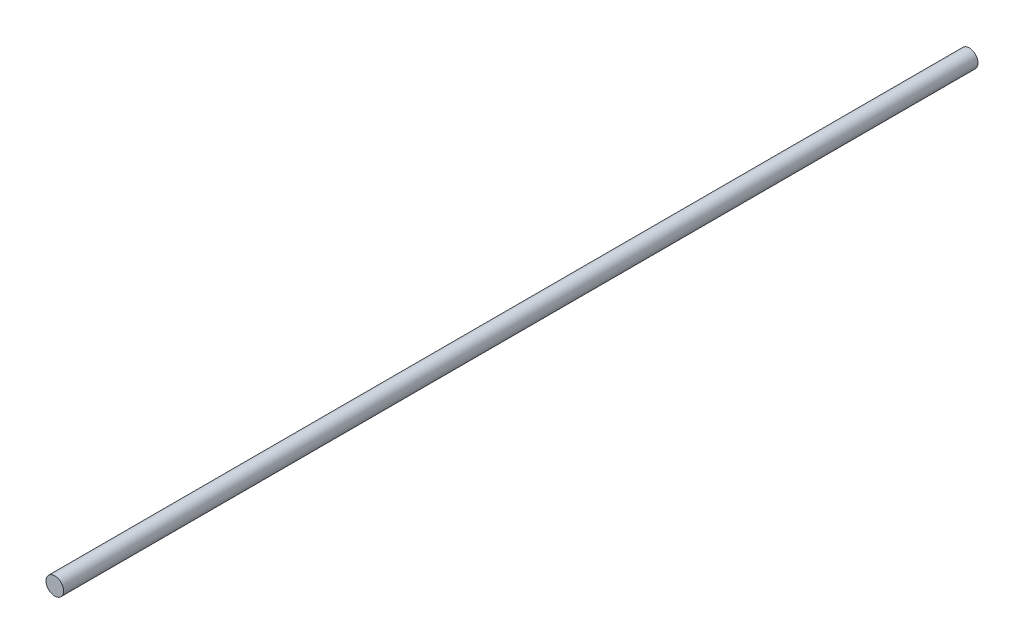
ISO-10303-21;
HEADER;
FILE_DESCRIPTION(('STEP AP214'),'2;1');
FILE_NAME('part.step','',(''),(''),'','','');
FILE_SCHEMA(('AUTOMOTIVE_DESIGN { 1 0 10303 214 1 1 1 1 }'));
ENDSEC;
DATA;
#1=APPLICATION_CONTEXT('core data for automotive mechanical design processes');
#2=APPLICATION_PROTOCOL_DEFINITION('international standard','automotive_design',2000,#1);
#3=PRODUCT_CONTEXT('',#1,'mechanical');
#4=PRODUCT('Part','Part','',(#3));
#5=PRODUCT_RELATED_PRODUCT_CATEGORY('part','',(#4));
#6=PRODUCT_DEFINITION_FORMATION('','',#4);
#7=PRODUCT_DEFINITION_CONTEXT('part definition',#1,'design');
#8=PRODUCT_DEFINITION('design','',#6,#7);
#9=PRODUCT_DEFINITION_SHAPE('','',#8);
#10=(LENGTH_UNIT() NAMED_UNIT(*) SI_UNIT(.MILLI.,.METRE.));
#11=(NAMED_UNIT(*) PLANE_ANGLE_UNIT() SI_UNIT($,.RADIAN.));
#12=(NAMED_UNIT(*) SI_UNIT($,.STERADIAN.) SOLID_ANGLE_UNIT());
#13=UNCERTAINTY_MEASURE_WITH_UNIT(LENGTH_MEASURE(1.E-05),#10,'distance_accuracy_value','');
#14=(GEOMETRIC_REPRESENTATION_CONTEXT(3) GLOBAL_UNCERTAINTY_ASSIGNED_CONTEXT((#13)) GLOBAL_UNIT_ASSIGNED_CONTEXT((#10,
#11,#12)) REPRESENTATION_CONTEXT('',''));
#15=CARTESIAN_POINT('',(0.,0.,0.));
#16=DIRECTION('',(0.,0.,1.));
#17=DIRECTION('',(1.,0.,0.));
#18=AXIS2_PLACEMENT_3D('',#15,#16,#17);
#19=CARTESIAN_POINT('',(0.,0.,260.));
#20=DIRECTION('',(0.,0.,-1.));
#21=DIRECTION('',(-1.,0.,0.));
#22=AXIS2_PLACEMENT_3D('',#19,#20,#21);
#23=CYLINDRICAL_SURFACE('',#22,2.5);
#24=CARTESIAN_POINT('',(0.,0.,260.));
#25=DIRECTION('',(0.,0.,1.));
#26=DIRECTION('',(1.,0.,0.));
#27=AXIS2_PLACEMENT_3D('',#24,#25,#26);
#28=CIRCLE('',#27,2.5);
#29=CARTESIAN_POINT('',(2.5,0.,260.));
#30=VERTEX_POINT('',#29);
#31=EDGE_CURVE('E10',#30,#30,#28,.T.);
#32=ORIENTED_EDGE('',*,*,#31,.F.);
#33=EDGE_LOOP('',(#32));
#34=FACE_BOUND('',#33,.T.);
#35=CARTESIAN_POINT('',(0.,0.,0.));
#36=DIRECTION('',(0.,0.,1.));
#37=DIRECTION('',(1.,0.,0.));
#38=AXIS2_PLACEMENT_3D('',#35,#36,#37);
#39=CIRCLE('',#38,2.5);
#40=CARTESIAN_POINT('',(2.5,0.,0.));
#41=VERTEX_POINT('',#40);
#42=EDGE_CURVE('E40',#41,#41,#39,.T.);
#43=ORIENTED_EDGE('',*,*,#42,.T.);
#44=EDGE_LOOP('',(#43));
#45=FACE_BOUND('',#44,.T.);
#46=ADVANCED_FACE('F37',(#34,#45),#23,.T.);
#47=CARTESIAN_POINT('',(0.,0.,260.));
#48=DIRECTION('',(0.,0.,1.));
#49=DIRECTION('',(1.,0.,0.));
#50=AXIS2_PLACEMENT_3D('',#47,#48,#49);
#51=PLANE('',#50);
#52=ORIENTED_EDGE('',*,*,#31,.T.);
#53=EDGE_LOOP('',(#52));
#54=FACE_BOUND('',#53,.T.);
#55=ADVANCED_FACE('F54',(#54),#51,.T.);
#56=CARTESIAN_POINT('',(0.,0.,0.));
#57=DIRECTION('',(0.,0.,1.));
#58=DIRECTION('',(1.,0.,0.));
#59=AXIS2_PLACEMENT_3D('',#56,#57,#58);
#60=PLANE('',#59);
#61=ORIENTED_EDGE('',*,*,#42,.F.);
#62=EDGE_LOOP('',(#61));
#63=FACE_BOUND('',#62,.T.);
#64=ADVANCED_FACE('F52',(#63),#60,.F.);
#65=CLOSED_SHELL('',(#46,#55,#64));
#66=MANIFOLD_SOLID_BREP('B2',#65);
#67=ADVANCED_BREP_SHAPE_REPRESENTATION('',(#18,#66),#14);
#68=SHAPE_DEFINITION_REPRESENTATION(#9,#67);
ENDSEC;
END-ISO-10303-21;
